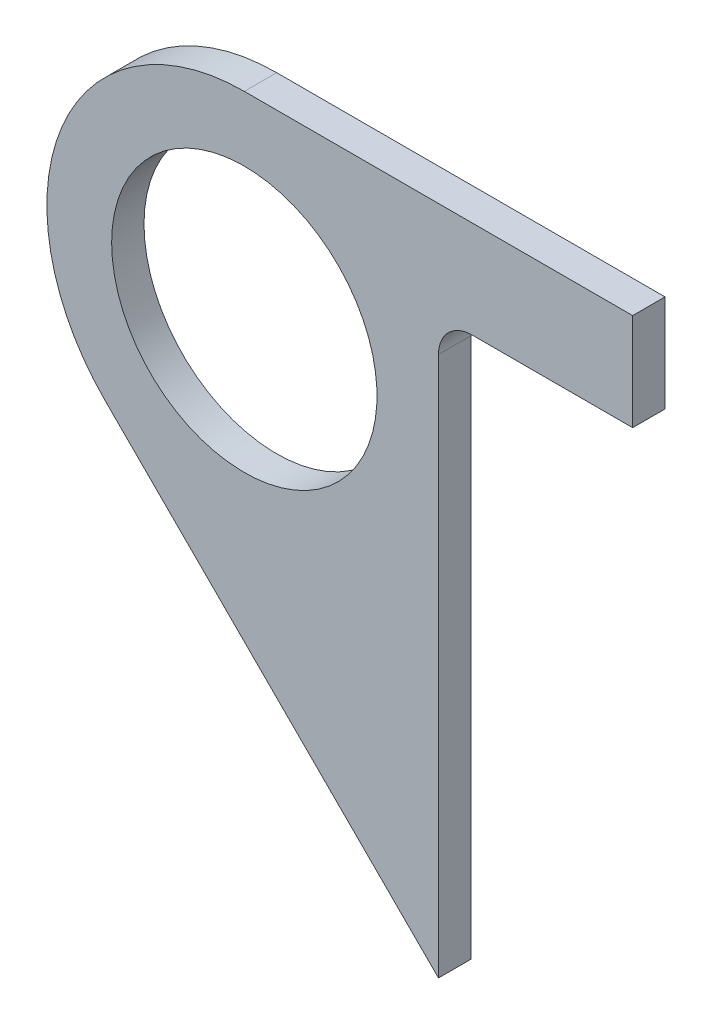
ISO-10303-21;
HEADER;
FILE_DESCRIPTION(('STEP AP214'),'2;1');
FILE_NAME('part.step','',(''),(''),'','','');
FILE_SCHEMA(('AUTOMOTIVE_DESIGN { 1 0 10303 214 1 1 1 1 }'));
ENDSEC;
DATA;
#1=APPLICATION_CONTEXT('core data for automotive mechanical design processes');
#2=APPLICATION_PROTOCOL_DEFINITION('international standard','automotive_design',2000,#1);
#3=PRODUCT_CONTEXT('',#1,'mechanical');
#4=PRODUCT('Part','Part','',(#3));
#5=PRODUCT_RELATED_PRODUCT_CATEGORY('part','',(#4));
#6=PRODUCT_DEFINITION_FORMATION('','',#4);
#7=PRODUCT_DEFINITION_CONTEXT('part definition',#1,'design');
#8=PRODUCT_DEFINITION('design','',#6,#7);
#9=PRODUCT_DEFINITION_SHAPE('','',#8);
#10=(LENGTH_UNIT() NAMED_UNIT(*) SI_UNIT(.MILLI.,.METRE.));
#11=(NAMED_UNIT(*) PLANE_ANGLE_UNIT() SI_UNIT($,.RADIAN.));
#12=(NAMED_UNIT(*) SI_UNIT($,.STERADIAN.) SOLID_ANGLE_UNIT());
#13=UNCERTAINTY_MEASURE_WITH_UNIT(LENGTH_MEASURE(1.E-05),#10,'distance_accuracy_value','');
#14=(GEOMETRIC_REPRESENTATION_CONTEXT(3) GLOBAL_UNCERTAINTY_ASSIGNED_CONTEXT((#13)) GLOBAL_UNIT_ASSIGNED_CONTEXT((#10,
#11,#12)) REPRESENTATION_CONTEXT('',''));
#15=CARTESIAN_POINT('',(0.,0.,0.));
#16=DIRECTION('',(0.,0.,1.));
#17=DIRECTION('',(1.,0.,0.));
#18=AXIS2_PLACEMENT_3D('',#15,#16,#17);
#19=CARTESIAN_POINT('',(-349.249999999993,564.515,450.849999999998));
#20=DIRECTION('',(0.,0.,1.));
#21=DIRECTION('',(1.,0.,0.));
#22=AXIS2_PLACEMENT_3D('',#19,#20,#21);
#23=PLANE('',#22);
#24=DIRECTION('',(1.,0.,0.));
#25=VECTOR('',#24,1.);
#26=CARTESIAN_POINT('',(-273.049999999993,603.25,450.849999999998));
#27=LINE('',#26,#25);
#28=CARTESIAN_POINT('',(-349.249999999993,603.25,450.849999999998));
#29=VERTEX_POINT('',#28);
#30=CARTESIAN_POINT('',(-273.049999999993,603.25,450.849999999998));
#31=VERTEX_POINT('',#30);
#32=EDGE_CURVE('E114',#29,#31,#27,.T.);
#33=ORIENTED_EDGE('',*,*,#32,.T.);
#34=DIRECTION('',(0.,-1.,0.));
#35=VECTOR('',#34,1.);
#36=CARTESIAN_POINT('',(-273.049999999993,603.25,450.849999999998));
#37=LINE('',#36,#35);
#38=CARTESIAN_POINT('',(-273.049999999993,584.2,450.849999999998));
#39=VERTEX_POINT('',#38);
#40=EDGE_CURVE('E104',#31,#39,#37,.T.);
#41=ORIENTED_EDGE('',*,*,#40,.T.);
#42=DIRECTION('',(-1.,0.,0.));
#43=VECTOR('',#42,1.);
#44=CARTESIAN_POINT('',(-273.049999999993,584.2,450.849999999998));
#45=LINE('',#44,#43);
#46=CARTESIAN_POINT('',(-304.545999999993,584.2,450.849999999998));
#47=VERTEX_POINT('',#46);
#48=EDGE_CURVE('E113',#39,#47,#45,.T.);
#49=ORIENTED_EDGE('',*,*,#48,.T.);
#50=CARTESIAN_POINT('',(-304.545999999993,577.596,450.849999999998));
#51=DIRECTION('',(0.,0.,1.));
#52=DIRECTION('',(1.,0.,0.));
#53=AXIS2_PLACEMENT_3D('',#50,#51,#52);
#54=CIRCLE('',#53,6.604);
#55=CARTESIAN_POINT('',(-311.149999999993,577.596,450.849999999998));
#56=VERTEX_POINT('',#55);
#57=EDGE_CURVE('E11',#47,#56,#54,.T.);
#58=ORIENTED_EDGE('',*,*,#57,.T.);
#59=DIRECTION('',(0.,-1.,0.));
#60=VECTOR('',#59,1.);
#61=CARTESIAN_POINT('',(-311.149999999993,584.2,450.849999999998));
#62=LINE('',#61,#60);
#63=CARTESIAN_POINT('',(-311.149999999993,471.635437661477,450.849999999998));
#64=VERTEX_POINT('',#63);
#65=EDGE_CURVE('E157',#56,#64,#62,.T.);
#66=ORIENTED_EDGE('',*,*,#65,.T.);
#67=DIRECTION('',(-0.707106781186543,0.707106781186552,0.));
#68=VECTOR('',#67,1.);
#69=CARTESIAN_POINT('',(-311.149999999993,471.635437661477,450.849999999998));
#70=LINE('',#69,#68);
#71=CARTESIAN_POINT('',(-376.639781169254,537.125218830739,450.849999999998));
#72=VERTEX_POINT('',#71);
#73=EDGE_CURVE('E155',#64,#72,#70,.T.);
#74=ORIENTED_EDGE('',*,*,#73,.T.);
#75=CARTESIAN_POINT('',(-349.249999999993,564.515,450.849999999998));
#76=DIRECTION('',(0.,0.,-1.));
#77=DIRECTION('',(1.,0.,0.));
#78=AXIS2_PLACEMENT_3D('',#75,#76,#77);
#79=CIRCLE('',#78,38.735);
#80=EDGE_CURVE('E119',#72,#29,#79,.T.);
#81=ORIENTED_EDGE('',*,*,#80,.T.);
#82=EDGE_LOOP('',(#33,#41,#49,#58,#66,#74,#81));
#83=FACE_BOUND('',#82,.T.);
#84=CARTESIAN_POINT('',(-349.249999999993,564.515,450.849999999998));
#85=DIRECTION('',(0.,0.,-1.));
#86=DIRECTION('',(-1.,0.,0.));
#87=AXIS2_PLACEMENT_3D('',#84,#85,#86);
#88=CIRCLE('',#87,26.0350000000001);
#89=CARTESIAN_POINT('',(-375.284999999993,564.515,450.849999999998));
#90=VERTEX_POINT('',#89);
#91=EDGE_CURVE('E153',#90,#90,#88,.T.);
#92=ORIENTED_EDGE('',*,*,#91,.F.);
#93=EDGE_LOOP('',(#92));
#94=FACE_BOUND('',#93,.T.);
#95=ADVANCED_FACE('F45',(#83,#94),#23,.F.);
#96=CARTESIAN_POINT('',(-349.249999999993,564.515,457.199999999998));
#97=DIRECTION('',(0.,0.,1.));
#98=DIRECTION('',(1.,0.,0.));
#99=AXIS2_PLACEMENT_3D('',#96,#97,#98);
#100=PLANE('',#99);
#101=DIRECTION('',(1.,0.,0.));
#102=VECTOR('',#101,1.);
#103=CARTESIAN_POINT('',(-273.049999999993,603.25,457.199999999998));
#104=LINE('',#103,#102);
#105=CARTESIAN_POINT('',(-349.249999999993,603.25,457.199999999998));
#106=VERTEX_POINT('',#105);
#107=CARTESIAN_POINT('',(-273.049999999993,603.25,457.199999999998));
#108=VERTEX_POINT('',#107);
#109=EDGE_CURVE('E127',#106,#108,#104,.T.);
#110=ORIENTED_EDGE('',*,*,#109,.F.);
#111=CARTESIAN_POINT('',(-349.249999999993,564.515,457.199999999998));
#112=DIRECTION('',(0.,0.,-1.));
#113=DIRECTION('',(1.,0.,0.));
#114=AXIS2_PLACEMENT_3D('',#111,#112,#113);
#115=CIRCLE('',#114,38.735);
#116=CARTESIAN_POINT('',(-376.639781169254,537.125218830739,457.199999999998));
#117=VERTEX_POINT('',#116);
#118=EDGE_CURVE('E123',#117,#106,#115,.T.);
#119=ORIENTED_EDGE('',*,*,#118,.F.);
#120=DIRECTION('',(-0.707106781186543,0.707106781186552,0.));
#121=VECTOR('',#120,1.);
#122=CARTESIAN_POINT('',(-311.149999999993,471.635437661477,457.199999999998));
#123=LINE('',#122,#121);
#124=CARTESIAN_POINT('',(-311.149999999993,471.635437661477,457.199999999998));
#125=VERTEX_POINT('',#124);
#126=EDGE_CURVE('E144',#125,#117,#123,.T.);
#127=ORIENTED_EDGE('',*,*,#126,.F.);
#128=DIRECTION('',(0.,-1.,0.));
#129=VECTOR('',#128,1.);
#130=CARTESIAN_POINT('',(-311.149999999993,584.2,457.199999999998));
#131=LINE('',#130,#129);
#132=CARTESIAN_POINT('',(-311.149999999993,577.596,457.199999999998));
#133=VERTEX_POINT('',#132);
#134=EDGE_CURVE('E146',#133,#125,#131,.T.);
#135=ORIENTED_EDGE('',*,*,#134,.F.);
#136=CARTESIAN_POINT('',(-304.545999999993,577.596,457.199999999998));
#137=DIRECTION('',(0.,0.,1.));
#138=DIRECTION('',(1.,0.,0.));
#139=AXIS2_PLACEMENT_3D('',#136,#137,#138);
#140=CIRCLE('',#139,6.604);
#141=CARTESIAN_POINT('',(-304.545999999993,584.2,457.199999999998));
#142=VERTEX_POINT('',#141);
#143=EDGE_CURVE('E53',#133,#142,#140,.F.);
#144=ORIENTED_EDGE('',*,*,#143,.T.);
#145=DIRECTION('',(-1.,0.,0.));
#146=VECTOR('',#145,1.);
#147=CARTESIAN_POINT('',(-273.049999999993,584.2,457.199999999998));
#148=LINE('',#147,#146);
#149=CARTESIAN_POINT('',(-273.049999999993,584.2,457.199999999998));
#150=VERTEX_POINT('',#149);
#151=EDGE_CURVE('E148',#150,#142,#148,.T.);
#152=ORIENTED_EDGE('',*,*,#151,.F.);
#153=DIRECTION('',(0.,-1.,0.));
#154=VECTOR('',#153,1.);
#155=CARTESIAN_POINT('',(-273.049999999993,603.25,457.199999999998));
#156=LINE('',#155,#154);
#157=EDGE_CURVE('E150',#108,#150,#156,.T.);
#158=ORIENTED_EDGE('',*,*,#157,.F.);
#159=EDGE_LOOP('',(#110,#119,#127,#135,#144,#152,#158));
#160=FACE_BOUND('',#159,.T.);
#161=CARTESIAN_POINT('',(-349.249999999993,564.515,457.199999999998));
#162=DIRECTION('',(0.,0.,-1.));
#163=DIRECTION('',(-1.,0.,0.));
#164=AXIS2_PLACEMENT_3D('',#161,#162,#163);
#165=CIRCLE('',#164,26.0350000000001);
#166=CARTESIAN_POINT('',(-375.284999999993,564.515,457.199999999998));
#167=VERTEX_POINT('',#166);
#168=EDGE_CURVE('E160',#167,#167,#165,.T.);
#169=ORIENTED_EDGE('',*,*,#168,.T.);
#170=EDGE_LOOP('',(#169));
#171=FACE_BOUND('',#170,.T.);
#172=ADVANCED_FACE('F169',(#160,#171),#100,.T.);
#173=CARTESIAN_POINT('',(-273.049999999993,603.25,450.849999999998));
#174=DIRECTION('',(0.,-1.,0.));
#175=DIRECTION('',(0.,0.,-1.));
#176=AXIS2_PLACEMENT_3D('',#173,#174,#175);
#177=PLANE('',#176);
#178=ORIENTED_EDGE('',*,*,#109,.T.);
#179=DIRECTION('',(0.,0.,1.));
#180=VECTOR('',#179,1.);
#181=CARTESIAN_POINT('',(-273.049999999993,603.25,450.849999999998));
#182=LINE('',#181,#180);
#183=EDGE_CURVE('E108',#31,#108,#182,.T.);
#184=ORIENTED_EDGE('',*,*,#183,.F.);
#185=ORIENTED_EDGE('',*,*,#32,.F.);
#186=DIRECTION('',(0.,0.,1.));
#187=VECTOR('',#186,1.);
#188=CARTESIAN_POINT('',(-349.249999999993,603.25,450.849999999998));
#189=LINE('',#188,#187);
#190=EDGE_CURVE('E141',#29,#106,#189,.T.);
#191=ORIENTED_EDGE('',*,*,#190,.T.);
#192=EDGE_LOOP('',(#178,#184,#185,#191));
#193=FACE_BOUND('',#192,.T.);
#194=ADVANCED_FACE('F125',(#193),#177,.F.);
#195=CARTESIAN_POINT('',(-273.049999999993,603.25,450.849999999998));
#196=DIRECTION('',(-1.,0.,0.));
#197=DIRECTION('',(0.,0.,1.));
#198=AXIS2_PLACEMENT_3D('',#195,#196,#197);
#199=PLANE('',#198);
#200=ORIENTED_EDGE('',*,*,#157,.T.);
#201=DIRECTION('',(0.,0.,1.));
#202=VECTOR('',#201,1.);
#203=CARTESIAN_POINT('',(-273.049999999993,584.2,450.849999999998));
#204=LINE('',#203,#202);
#205=EDGE_CURVE('E111',#39,#150,#204,.T.);
#206=ORIENTED_EDGE('',*,*,#205,.F.);
#207=ORIENTED_EDGE('',*,*,#40,.F.);
#208=ORIENTED_EDGE('',*,*,#183,.T.);
#209=EDGE_LOOP('',(#200,#206,#207,#208));
#210=FACE_BOUND('',#209,.T.);
#211=ADVANCED_FACE('F106',(#210),#199,.F.);
#212=CARTESIAN_POINT('',(-273.049999999993,584.2,450.849999999998));
#213=DIRECTION('',(0.,1.,0.));
#214=DIRECTION('',(0.,0.,1.));
#215=AXIS2_PLACEMENT_3D('',#212,#213,#214);
#216=PLANE('',#215);
#217=ORIENTED_EDGE('',*,*,#151,.T.);
#218=DIRECTION('',(0.,0.,1.));
#219=VECTOR('',#218,1.);
#220=CARTESIAN_POINT('',(-304.545999999993,584.2,450.849999999998));
#221=LINE('',#220,#219);
#222=EDGE_CURVE('E60',#142,#47,#221,.F.);
#223=ORIENTED_EDGE('',*,*,#222,.T.);
#224=ORIENTED_EDGE('',*,*,#48,.F.);
#225=ORIENTED_EDGE('',*,*,#205,.T.);
#226=EDGE_LOOP('',(#217,#223,#224,#225));
#227=FACE_BOUND('',#226,.T.);
#228=ADVANCED_FACE('F189',(#227),#216,.F.);
#229=CARTESIAN_POINT('',(-311.149999999993,584.2,450.849999999998));
#230=DIRECTION('',(-1.,0.,0.));
#231=DIRECTION('',(0.,0.,1.));
#232=AXIS2_PLACEMENT_3D('',#229,#230,#231);
#233=PLANE('',#232);
#234=ORIENTED_EDGE('',*,*,#65,.F.);
#235=DIRECTION('',(0.,0.,1.));
#236=VECTOR('',#235,1.);
#237=CARTESIAN_POINT('',(-311.149999999993,577.596,457.199999999998));
#238=LINE('',#237,#236);
#239=EDGE_CURVE('E128',#56,#133,#238,.T.);
#240=ORIENTED_EDGE('',*,*,#239,.T.);
#241=ORIENTED_EDGE('',*,*,#134,.T.);
#242=DIRECTION('',(0.,0.,1.));
#243=VECTOR('',#242,1.);
#244=CARTESIAN_POINT('',(-311.149999999993,471.635437661477,450.849999999998));
#245=LINE('',#244,#243);
#246=EDGE_CURVE('E132',#64,#125,#245,.T.);
#247=ORIENTED_EDGE('',*,*,#246,.F.);
#248=EDGE_LOOP('',(#234,#240,#241,#247));
#249=FACE_BOUND('',#248,.T.);
#250=ADVANCED_FACE('F185',(#249),#233,.F.);
#251=CARTESIAN_POINT('',(-311.149999999993,471.635437661477,450.849999999998));
#252=DIRECTION('',(0.707106781186552,0.707106781186543,0.));
#253=DIRECTION('',(-0.707106781186543,0.707106781186552,0.));
#254=AXIS2_PLACEMENT_3D('',#251,#252,#253);
#255=PLANE('',#254);
#256=ORIENTED_EDGE('',*,*,#126,.T.);
#257=DIRECTION('',(0.,0.,1.));
#258=VECTOR('',#257,1.);
#259=CARTESIAN_POINT('',(-376.639781169254,537.125218830739,450.849999999998));
#260=LINE('',#259,#258);
#261=EDGE_CURVE('E138',#72,#117,#260,.T.);
#262=ORIENTED_EDGE('',*,*,#261,.F.);
#263=ORIENTED_EDGE('',*,*,#73,.F.);
#264=ORIENTED_EDGE('',*,*,#246,.T.);
#265=EDGE_LOOP('',(#256,#262,#263,#264));
#266=FACE_BOUND('',#265,.T.);
#267=ADVANCED_FACE('F181',(#266),#255,.F.);
#268=CARTESIAN_POINT('',(-349.249999999993,564.515,450.849999999998));
#269=DIRECTION('',(0.,0.,1.));
#270=DIRECTION('',(1.,0.,0.));
#271=AXIS2_PLACEMENT_3D('',#268,#269,#270);
#272=CYLINDRICAL_SURFACE('',#271,38.735);
#273=ORIENTED_EDGE('',*,*,#118,.T.);
#274=ORIENTED_EDGE('',*,*,#190,.F.);
#275=ORIENTED_EDGE('',*,*,#80,.F.);
#276=ORIENTED_EDGE('',*,*,#261,.T.);
#277=EDGE_LOOP('',(#273,#274,#275,#276));
#278=FACE_BOUND('',#277,.T.);
#279=ADVANCED_FACE('F178',(#278),#272,.T.);
#280=CARTESIAN_POINT('',(-349.249999999993,564.515,450.849999999998));
#281=DIRECTION('',(0.,0.,1.));
#282=DIRECTION('',(1.,0.,0.));
#283=AXIS2_PLACEMENT_3D('',#280,#281,#282);
#284=CYLINDRICAL_SURFACE('',#283,26.0350000000001);
#285=ORIENTED_EDGE('',*,*,#91,.T.);
#286=EDGE_LOOP('',(#285));
#287=FACE_BOUND('',#286,.T.);
#288=ORIENTED_EDGE('',*,*,#168,.F.);
#289=EDGE_LOOP('',(#288));
#290=FACE_BOUND('',#289,.T.);
#291=ADVANCED_FACE('F166',(#287,#290),#284,.F.);
#292=CARTESIAN_POINT('',(-304.545999999993,577.596,450.849999999998));
#293=DIRECTION('',(0.,0.,-1.));
#294=DIRECTION('',(-1.,0.,0.));
#295=AXIS2_PLACEMENT_3D('',#292,#293,#294);
#296=CYLINDRICAL_SURFACE('',#295,6.604);
#297=ORIENTED_EDGE('',*,*,#57,.F.);
#298=ORIENTED_EDGE('',*,*,#222,.F.);
#299=ORIENTED_EDGE('',*,*,#143,.F.);
#300=ORIENTED_EDGE('',*,*,#239,.F.);
#301=EDGE_LOOP('',(#297,#298,#299,#300));
#302=FACE_BOUND('',#301,.T.);
#303=ADVANCED_FACE('F47',(#302),#296,.F.);
#304=CLOSED_SHELL('',(#95,#172,#194,#211,#228,#250,#267,#279,#291,#303));
#305=MANIFOLD_SOLID_BREP('B2',#304);
#306=ADVANCED_BREP_SHAPE_REPRESENTATION('',(#18,#305),#14);
#307=SHAPE_DEFINITION_REPRESENTATION(#9,#306);
ENDSEC;
END-ISO-10303-21;
